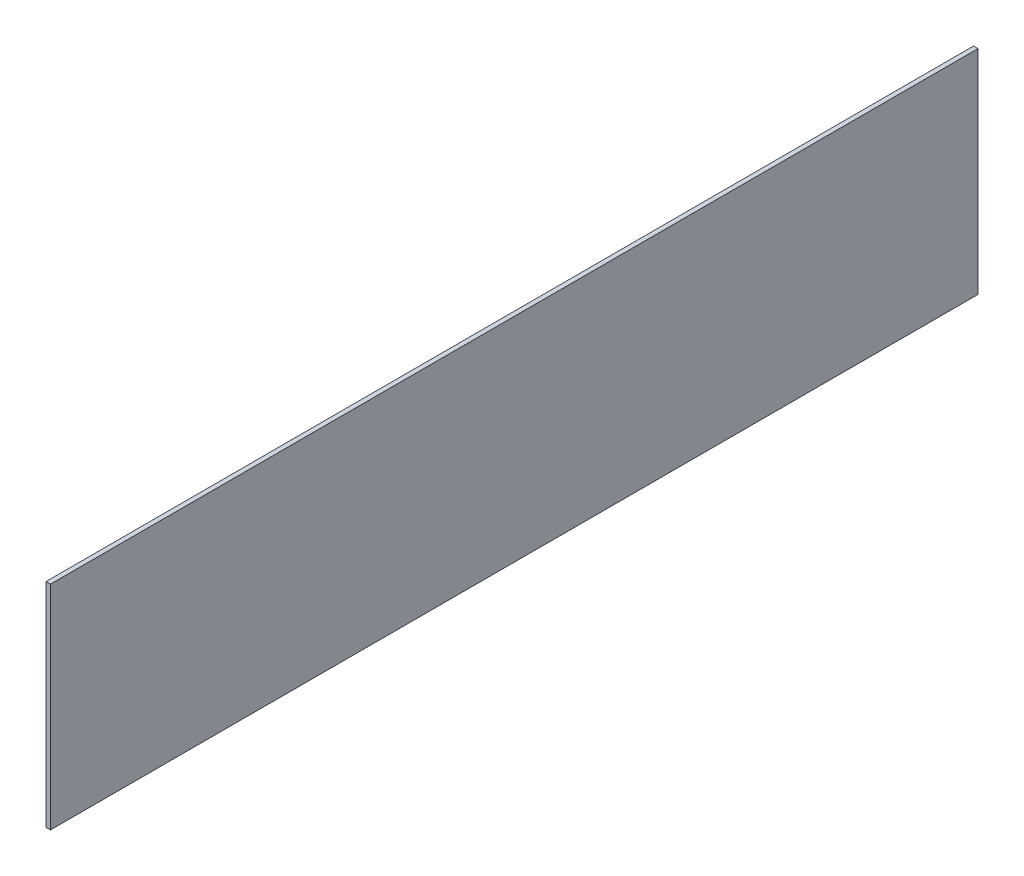
ISO-10303-21;
HEADER;
FILE_DESCRIPTION(('STEP AP214'),'2;1');
FILE_NAME('part.step','',(''),(''),'','','');
FILE_SCHEMA(('AUTOMOTIVE_DESIGN { 1 0 10303 214 1 1 1 1 }'));
ENDSEC;
DATA;
#1=APPLICATION_CONTEXT('core data for automotive mechanical design processes');
#2=APPLICATION_PROTOCOL_DEFINITION('international standard','automotive_design',2000,#1);
#3=PRODUCT_CONTEXT('',#1,'mechanical');
#4=PRODUCT('Part','Part','',(#3));
#5=PRODUCT_RELATED_PRODUCT_CATEGORY('part','',(#4));
#6=PRODUCT_DEFINITION_FORMATION('','',#4);
#7=PRODUCT_DEFINITION_CONTEXT('part definition',#1,'design');
#8=PRODUCT_DEFINITION('design','',#6,#7);
#9=PRODUCT_DEFINITION_SHAPE('','',#8);
#10=(LENGTH_UNIT() NAMED_UNIT(*) SI_UNIT(.MILLI.,.METRE.));
#11=(NAMED_UNIT(*) PLANE_ANGLE_UNIT() SI_UNIT($,.RADIAN.));
#12=(NAMED_UNIT(*) SI_UNIT($,.STERADIAN.) SOLID_ANGLE_UNIT());
#13=UNCERTAINTY_MEASURE_WITH_UNIT(LENGTH_MEASURE(1.E-05),#10,'distance_accuracy_value','');
#14=(GEOMETRIC_REPRESENTATION_CONTEXT(3) GLOBAL_UNCERTAINTY_ASSIGNED_CONTEXT((#13)) GLOBAL_UNIT_ASSIGNED_CONTEXT((#10,
#11,#12)) REPRESENTATION_CONTEXT('',''));
#15=CARTESIAN_POINT('',(0.,0.,0.));
#16=DIRECTION('',(0.,0.,1.));
#17=DIRECTION('',(1.,0.,0.));
#18=AXIS2_PLACEMENT_3D('',#15,#16,#17);
#19=CARTESIAN_POINT('',(3.,68.5,311.5));
#20=DIRECTION('',(0.,0.,-1.));
#21=DIRECTION('',(0.,1.,0.));
#22=AXIS2_PLACEMENT_3D('',#19,#20,#21);
#23=PLANE('',#22);
#24=DIRECTION('',(0.,-1.,0.));
#25=VECTOR('',#24,1.);
#26=CARTESIAN_POINT('',(0.,68.5,311.5));
#27=LINE('',#26,#25);
#28=CARTESIAN_POINT('',(0.,71.5,311.5));
#29=VERTEX_POINT('',#28);
#30=CARTESIAN_POINT('',(0.,-71.5,311.5));
#31=VERTEX_POINT('',#30);
#32=EDGE_CURVE('E72',#29,#31,#27,.T.);
#33=ORIENTED_EDGE('',*,*,#32,.T.);
#34=DIRECTION('',(-1.,0.,0.));
#35=VECTOR('',#34,1.);
#36=CARTESIAN_POINT('',(3.,-71.5,311.5));
#37=LINE('',#36,#35);
#38=CARTESIAN_POINT('',(3.,-71.5,311.5));
#39=VERTEX_POINT('',#38);
#40=EDGE_CURVE('E11',#39,#31,#37,.T.);
#41=ORIENTED_EDGE('',*,*,#40,.F.);
#42=DIRECTION('',(0.,-1.,0.));
#43=VECTOR('',#42,1.);
#44=CARTESIAN_POINT('',(3.,71.5,311.5));
#45=LINE('',#44,#43);
#46=CARTESIAN_POINT('',(3.,71.5,311.5));
#47=VERTEX_POINT('',#46);
#48=EDGE_CURVE('E77',#47,#39,#45,.T.);
#49=ORIENTED_EDGE('',*,*,#48,.F.);
#50=DIRECTION('',(-1.,0.,0.));
#51=VECTOR('',#50,1.);
#52=CARTESIAN_POINT('',(3.,71.5,311.5));
#53=LINE('',#52,#51);
#54=EDGE_CURVE('E93',#47,#29,#53,.T.);
#55=ORIENTED_EDGE('',*,*,#54,.T.);
#56=EDGE_LOOP('',(#33,#41,#49,#55));
#57=FACE_BOUND('',#56,.T.);
#58=ADVANCED_FACE('F33',(#57),#23,.F.);
#59=CARTESIAN_POINT('',(3.,-71.5,-308.5));
#60=DIRECTION('',(0.,1.,0.));
#61=DIRECTION('',(0.,0.,1.));
#62=AXIS2_PLACEMENT_3D('',#59,#60,#61);
#63=PLANE('',#62);
#64=DIRECTION('',(0.,0.,-1.));
#65=VECTOR('',#64,1.);
#66=CARTESIAN_POINT('',(0.,-71.5,-308.5));
#67=LINE('',#66,#65);
#68=CARTESIAN_POINT('',(0.,-71.5,-311.5));
#69=VERTEX_POINT('',#68);
#70=EDGE_CURVE('E89',#31,#69,#67,.T.);
#71=ORIENTED_EDGE('',*,*,#70,.T.);
#72=DIRECTION('',(-1.,0.,0.));
#73=VECTOR('',#72,1.);
#74=CARTESIAN_POINT('',(3.,-71.5,-311.5));
#75=LINE('',#74,#73);
#76=CARTESIAN_POINT('',(3.,-71.5,-311.5));
#77=VERTEX_POINT('',#76);
#78=EDGE_CURVE('E41',#77,#69,#75,.T.);
#79=ORIENTED_EDGE('',*,*,#78,.F.);
#80=DIRECTION('',(0.,0.,-1.));
#81=VECTOR('',#80,1.);
#82=CARTESIAN_POINT('',(3.,-71.5,311.5));
#83=LINE('',#82,#81);
#84=EDGE_CURVE('E80',#39,#77,#83,.T.);
#85=ORIENTED_EDGE('',*,*,#84,.F.);
#86=ORIENTED_EDGE('',*,*,#40,.T.);
#87=EDGE_LOOP('',(#71,#79,#85,#86));
#88=FACE_BOUND('',#87,.T.);
#89=ADVANCED_FACE('F88',(#88),#63,.F.);
#90=CARTESIAN_POINT('',(3.,68.5,-311.5));
#91=DIRECTION('',(0.,0.,1.));
#92=DIRECTION('',(1.,0.,0.));
#93=AXIS2_PLACEMENT_3D('',#90,#91,#92);
#94=PLANE('',#93);
#95=DIRECTION('',(0.,1.,0.));
#96=VECTOR('',#95,1.);
#97=CARTESIAN_POINT('',(0.,68.5,-311.5));
#98=LINE('',#97,#96);
#99=CARTESIAN_POINT('',(0.,71.5,-311.5));
#100=VERTEX_POINT('',#99);
#101=EDGE_CURVE('E65',#69,#100,#98,.T.);
#102=ORIENTED_EDGE('',*,*,#101,.T.);
#103=DIRECTION('',(-1.,0.,0.));
#104=VECTOR('',#103,1.);
#105=CARTESIAN_POINT('',(3.,71.5,-311.5));
#106=LINE('',#105,#104);
#107=CARTESIAN_POINT('',(3.,71.5,-311.5));
#108=VERTEX_POINT('',#107);
#109=EDGE_CURVE('E90',#108,#100,#106,.T.);
#110=ORIENTED_EDGE('',*,*,#109,.F.);
#111=DIRECTION('',(0.,1.,0.));
#112=VECTOR('',#111,1.);
#113=CARTESIAN_POINT('',(3.,-71.5,-311.5));
#114=LINE('',#113,#112);
#115=EDGE_CURVE('E84',#77,#108,#114,.T.);
#116=ORIENTED_EDGE('',*,*,#115,.F.);
#117=ORIENTED_EDGE('',*,*,#78,.T.);
#118=EDGE_LOOP('',(#102,#110,#116,#117));
#119=FACE_BOUND('',#118,.T.);
#120=ADVANCED_FACE('F91',(#119),#94,.F.);
#121=CARTESIAN_POINT('',(3.,71.5,-311.5));
#122=DIRECTION('',(0.,-1.,0.));
#123=DIRECTION('',(0.,0.,-1.));
#124=AXIS2_PLACEMENT_3D('',#121,#122,#123);
#125=PLANE('',#124);
#126=DIRECTION('',(0.,0.,1.));
#127=VECTOR('',#126,1.);
#128=CARTESIAN_POINT('',(0.,71.5,-311.5));
#129=LINE('',#128,#127);
#130=EDGE_CURVE('E100',#100,#29,#129,.T.);
#131=ORIENTED_EDGE('',*,*,#130,.T.);
#132=ORIENTED_EDGE('',*,*,#54,.F.);
#133=DIRECTION('',(0.,0.,1.));
#134=VECTOR('',#133,1.);
#135=CARTESIAN_POINT('',(3.,71.5,-311.5));
#136=LINE('',#135,#134);
#137=EDGE_CURVE('E49',#108,#47,#136,.T.);
#138=ORIENTED_EDGE('',*,*,#137,.F.);
#139=ORIENTED_EDGE('',*,*,#109,.T.);
#140=EDGE_LOOP('',(#131,#132,#138,#139));
#141=FACE_BOUND('',#140,.T.);
#142=ADVANCED_FACE('F105',(#141),#125,.F.);
#143=CARTESIAN_POINT('',(3.,0.,0.));
#144=DIRECTION('',(1.,0.,0.));
#145=DIRECTION('',(0.,0.,-1.));
#146=AXIS2_PLACEMENT_3D('',#143,#144,#145);
#147=PLANE('',#146);
#148=ORIENTED_EDGE('',*,*,#48,.T.);
#149=ORIENTED_EDGE('',*,*,#84,.T.);
#150=ORIENTED_EDGE('',*,*,#115,.T.);
#151=ORIENTED_EDGE('',*,*,#137,.T.);
#152=EDGE_LOOP('',(#148,#149,#150,#151));
#153=FACE_BOUND('',#152,.T.);
#154=ADVANCED_FACE('F82',(#153),#147,.T.);
#155=CARTESIAN_POINT('',(0.,0.,0.));
#156=DIRECTION('',(1.,0.,0.));
#157=DIRECTION('',(0.,0.,-1.));
#158=AXIS2_PLACEMENT_3D('',#155,#156,#157);
#159=PLANE('',#158);
#160=ORIENTED_EDGE('',*,*,#32,.F.);
#161=ORIENTED_EDGE('',*,*,#130,.F.);
#162=ORIENTED_EDGE('',*,*,#101,.F.);
#163=ORIENTED_EDGE('',*,*,#70,.F.);
#164=EDGE_LOOP('',(#160,#161,#162,#163));
#165=FACE_BOUND('',#164,.T.);
#166=ADVANCED_FACE('F106',(#165),#159,.F.);
#167=CLOSED_SHELL('',(#58,#89,#120,#142,#154,#166));
#168=MANIFOLD_SOLID_BREP('B2',#167);
#169=ADVANCED_BREP_SHAPE_REPRESENTATION('',(#18,#168),#14);
#170=SHAPE_DEFINITION_REPRESENTATION(#9,#169);
ENDSEC;
END-ISO-10303-21;
